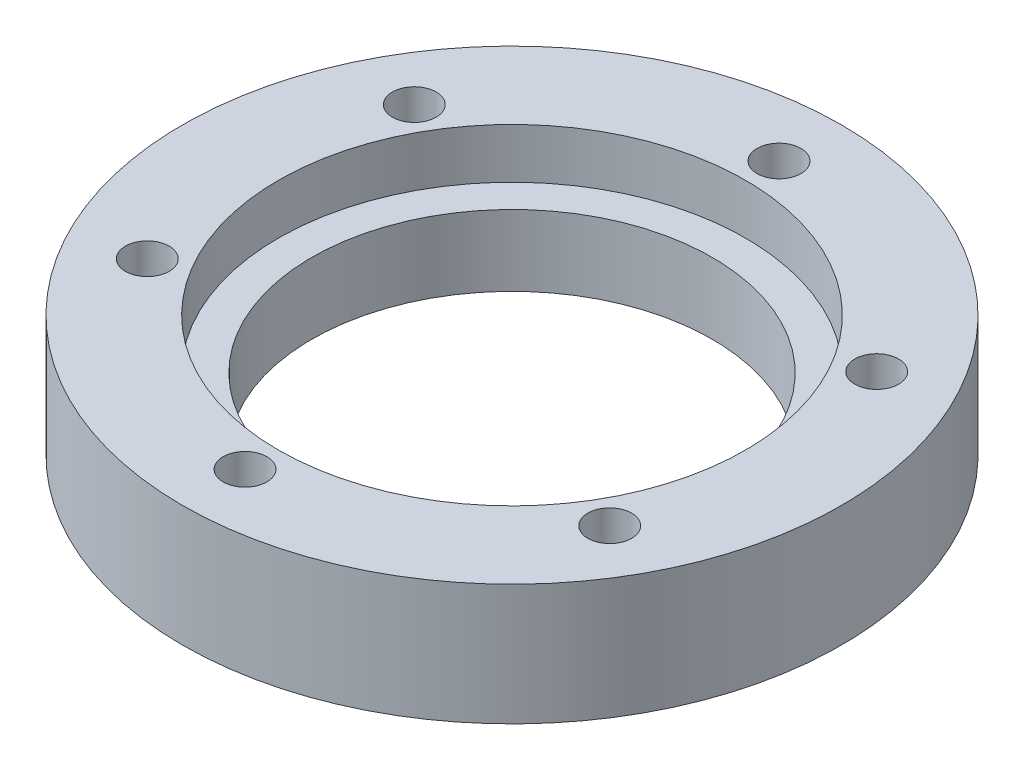
ISO-10303-21;
HEADER;
FILE_DESCRIPTION(('STEP AP214'),'2;1');
FILE_NAME('part.step','',(''),(''),'','','');
FILE_SCHEMA(('AUTOMOTIVE_DESIGN { 1 0 10303 214 1 1 1 1 }'));
ENDSEC;
DATA;
#1=APPLICATION_CONTEXT('core data for automotive mechanical design processes');
#2=APPLICATION_PROTOCOL_DEFINITION('international standard','automotive_design',2000,#1);
#3=PRODUCT_CONTEXT('',#1,'mechanical');
#4=PRODUCT('Part','Part','',(#3));
#5=PRODUCT_RELATED_PRODUCT_CATEGORY('part','',(#4));
#6=PRODUCT_DEFINITION_FORMATION('','',#4);
#7=PRODUCT_DEFINITION_CONTEXT('part definition',#1,'design');
#8=PRODUCT_DEFINITION('design','',#6,#7);
#9=PRODUCT_DEFINITION_SHAPE('','',#8);
#10=(LENGTH_UNIT() NAMED_UNIT(*) SI_UNIT(.MILLI.,.METRE.));
#11=(NAMED_UNIT(*) PLANE_ANGLE_UNIT() SI_UNIT($,.RADIAN.));
#12=(NAMED_UNIT(*) SI_UNIT($,.STERADIAN.) SOLID_ANGLE_UNIT());
#13=UNCERTAINTY_MEASURE_WITH_UNIT(LENGTH_MEASURE(1.E-05),#10,'distance_accuracy_value','');
#14=(GEOMETRIC_REPRESENTATION_CONTEXT(3) GLOBAL_UNCERTAINTY_ASSIGNED_CONTEXT((#13)) GLOBAL_UNIT_ASSIGNED_CONTEXT((#10,
#11,#12)) REPRESENTATION_CONTEXT('',''));
#15=CARTESIAN_POINT('',(0.,0.,0.));
#16=DIRECTION('',(0.,0.,1.));
#17=DIRECTION('',(1.,0.,0.));
#18=AXIS2_PLACEMENT_3D('',#15,#16,#17);
#19=CARTESIAN_POINT('',(0.,29.,0.));
#20=DIRECTION('',(0.,-1.,0.));
#21=DIRECTION('',(0.,0.,-1.));
#22=AXIS2_PLACEMENT_3D('',#19,#20,#21);
#23=CYLINDRICAL_SURFACE('',#22,79.);
#24=CARTESIAN_POINT('',(0.,29.,0.));
#25=DIRECTION('',(0.,1.,0.));
#26=DIRECTION('',(0.,0.,1.));
#27=AXIS2_PLACEMENT_3D('',#24,#25,#26);
#28=CIRCLE('',#27,79.);
#29=CARTESIAN_POINT('',(0.,29.,79.));
#30=VERTEX_POINT('',#29);
#31=EDGE_CURVE('E12',#30,#30,#28,.T.);
#32=ORIENTED_EDGE('',*,*,#31,.F.);
#33=EDGE_LOOP('',(#32));
#34=FACE_BOUND('',#33,.T.);
#35=CARTESIAN_POINT('',(0.,0.,0.));
#36=DIRECTION('',(0.,1.,0.));
#37=DIRECTION('',(0.,0.,1.));
#38=AXIS2_PLACEMENT_3D('',#35,#36,#37);
#39=CIRCLE('',#38,79.);
#40=CARTESIAN_POINT('',(0.,0.,79.));
#41=VERTEX_POINT('',#40);
#42=EDGE_CURVE('E52',#41,#41,#39,.T.);
#43=ORIENTED_EDGE('',*,*,#42,.T.);
#44=EDGE_LOOP('',(#43));
#45=FACE_BOUND('',#44,.T.);
#46=ADVANCED_FACE('F49',(#34,#45),#23,.T.);
#47=CARTESIAN_POINT('',(0.,29.,0.));
#48=DIRECTION('',(0.,1.,0.));
#49=DIRECTION('',(0.,0.,1.));
#50=AXIS2_PLACEMENT_3D('',#47,#48,#49);
#51=PLANE('',#50);
#52=CARTESIAN_POINT('',(7.42461647718073E-13,29.,64.));
#53=DIRECTION('',(0.,1.,0.));
#54=DIRECTION('',(0.,0.,1.));
#55=AXIS2_PLACEMENT_3D('',#52,#53,#54);
#56=CIRCLE('',#55,5.25);
#57=CARTESIAN_POINT('',(7.42461647718073E-13,29.,69.25));
#58=VERTEX_POINT('',#57);
#59=EDGE_CURVE('E105',#58,#58,#56,.T.);
#60=ORIENTED_EDGE('',*,*,#59,.F.);
#61=EDGE_LOOP('',(#60));
#62=FACE_BOUND('',#61,.T.);
#63=CARTESIAN_POINT('',(-55.4256258422038,29.,32.0000000000005));
#64=DIRECTION('',(0.,1.,0.));
#65=DIRECTION('',(0.,0.,1.));
#66=AXIS2_PLACEMENT_3D('',#63,#64,#65);
#67=CIRCLE('',#66,5.25);
#68=CARTESIAN_POINT('',(-55.4256258422038,29.,37.2500000000005));
#69=VERTEX_POINT('',#68);
#70=EDGE_CURVE('E99',#69,#69,#67,.T.);
#71=ORIENTED_EDGE('',*,*,#70,.F.);
#72=EDGE_LOOP('',(#71));
#73=FACE_BOUND('',#72,.T.);
#74=CARTESIAN_POINT('',(-55.4256258422041,29.,-32.));
#75=DIRECTION('',(0.,1.,0.));
#76=DIRECTION('',(0.,0.,1.));
#77=AXIS2_PLACEMENT_3D('',#74,#75,#76);
#78=CIRCLE('',#77,5.25);
#79=CARTESIAN_POINT('',(-55.4256258422041,29.,-26.75));
#80=VERTEX_POINT('',#79);
#81=EDGE_CURVE('E93',#80,#80,#78,.T.);
#82=ORIENTED_EDGE('',*,*,#81,.F.);
#83=EDGE_LOOP('',(#82));
#84=FACE_BOUND('',#83,.T.);
#85=CARTESIAN_POINT('',(-2.94902990916057E-13,29.,-64.));
#86=DIRECTION('',(0.,1.,0.));
#87=DIRECTION('',(0.,0.,1.));
#88=AXIS2_PLACEMENT_3D('',#85,#86,#87);
#89=CIRCLE('',#88,5.25);
#90=CARTESIAN_POINT('',(-2.94902990916057E-13,29.,-58.75));
#91=VERTEX_POINT('',#90);
#92=EDGE_CURVE('E87',#91,#91,#89,.T.);
#93=ORIENTED_EDGE('',*,*,#92,.F.);
#94=EDGE_LOOP('',(#93));
#95=FACE_BOUND('',#94,.T.);
#96=CARTESIAN_POINT('',(55.425625842204,29.,-32.0000000000001));
#97=DIRECTION('',(0.,1.,0.));
#98=DIRECTION('',(0.,0.,1.));
#99=AXIS2_PLACEMENT_3D('',#96,#97,#98);
#100=CIRCLE('',#99,5.25);
#101=CARTESIAN_POINT('',(55.425625842204,29.,-26.7500000000001));
#102=VERTEX_POINT('',#101);
#103=EDGE_CURVE('E81',#102,#102,#100,.T.);
#104=ORIENTED_EDGE('',*,*,#103,.F.);
#105=EDGE_LOOP('',(#104));
#106=FACE_BOUND('',#105,.T.);
#107=CARTESIAN_POINT('',(55.4256258422041,29.,32.));
#108=DIRECTION('',(0.,1.,0.));
#109=DIRECTION('',(0.,0.,1.));
#110=AXIS2_PLACEMENT_3D('',#107,#108,#109);
#111=CIRCLE('',#110,5.25);
#112=CARTESIAN_POINT('',(55.4256258422041,29.,37.25));
#113=VERTEX_POINT('',#112);
#114=EDGE_CURVE('E75',#113,#113,#111,.T.);
#115=ORIENTED_EDGE('',*,*,#114,.F.);
#116=EDGE_LOOP('',(#115));
#117=FACE_BOUND('',#116,.T.);
#118=CARTESIAN_POINT('',(0.,29.,0.));
#119=DIRECTION('',(0.,1.,0.));
#120=DIRECTION('',(0.,0.,1.));
#121=AXIS2_PLACEMENT_3D('',#118,#119,#120);
#122=CIRCLE('',#121,56.);
#123=CARTESIAN_POINT('',(0.,29.,56.));
#124=VERTEX_POINT('',#123);
#125=EDGE_CURVE('E69',#124,#124,#122,.T.);
#126=ORIENTED_EDGE('',*,*,#125,.F.);
#127=EDGE_LOOP('',(#126));
#128=FACE_BOUND('',#127,.T.);
#129=ORIENTED_EDGE('',*,*,#31,.T.);
#130=EDGE_LOOP('',(#129));
#131=FACE_BOUND('',#130,.T.);
#132=ADVANCED_FACE('F111',(#62,#73,#84,#95,#106,#117,#128,#131),#51,.T.);
#133=CARTESIAN_POINT('',(0.,0.,0.));
#134=DIRECTION('',(0.,1.,0.));
#135=DIRECTION('',(0.,0.,1.));
#136=AXIS2_PLACEMENT_3D('',#133,#134,#135);
#137=PLANE('',#136);
#138=CARTESIAN_POINT('',(7.42461647718073E-13,0.,64.));
#139=DIRECTION('',(0.,1.,0.));
#140=DIRECTION('',(0.,0.,1.));
#141=AXIS2_PLACEMENT_3D('',#138,#139,#140);
#142=CIRCLE('',#141,5.25);
#143=CARTESIAN_POINT('',(7.42461647718073E-13,0.,69.25));
#144=VERTEX_POINT('',#143);
#145=EDGE_CURVE('E102',#144,#144,#142,.T.);
#146=ORIENTED_EDGE('',*,*,#145,.T.);
#147=EDGE_LOOP('',(#146));
#148=FACE_BOUND('',#147,.T.);
#149=CARTESIAN_POINT('',(-55.4256258422038,0.,32.0000000000005));
#150=DIRECTION('',(0.,1.,0.));
#151=DIRECTION('',(0.,0.,1.));
#152=AXIS2_PLACEMENT_3D('',#149,#150,#151);
#153=CIRCLE('',#152,5.25);
#154=CARTESIAN_POINT('',(-55.4256258422038,0.,37.2500000000005));
#155=VERTEX_POINT('',#154);
#156=EDGE_CURVE('E96',#155,#155,#153,.T.);
#157=ORIENTED_EDGE('',*,*,#156,.T.);
#158=EDGE_LOOP('',(#157));
#159=FACE_BOUND('',#158,.T.);
#160=CARTESIAN_POINT('',(-55.4256258422041,0.,-32.));
#161=DIRECTION('',(0.,1.,0.));
#162=DIRECTION('',(0.,0.,1.));
#163=AXIS2_PLACEMENT_3D('',#160,#161,#162);
#164=CIRCLE('',#163,5.25);
#165=CARTESIAN_POINT('',(-55.4256258422041,0.,-26.75));
#166=VERTEX_POINT('',#165);
#167=EDGE_CURVE('E90',#166,#166,#164,.T.);
#168=ORIENTED_EDGE('',*,*,#167,.T.);
#169=EDGE_LOOP('',(#168));
#170=FACE_BOUND('',#169,.T.);
#171=CARTESIAN_POINT('',(-2.94902990916057E-13,0.,-64.));
#172=DIRECTION('',(0.,1.,0.));
#173=DIRECTION('',(0.,0.,1.));
#174=AXIS2_PLACEMENT_3D('',#171,#172,#173);
#175=CIRCLE('',#174,5.25);
#176=CARTESIAN_POINT('',(-2.94902990916057E-13,0.,-58.75));
#177=VERTEX_POINT('',#176);
#178=EDGE_CURVE('E84',#177,#177,#175,.T.);
#179=ORIENTED_EDGE('',*,*,#178,.T.);
#180=EDGE_LOOP('',(#179));
#181=FACE_BOUND('',#180,.T.);
#182=CARTESIAN_POINT('',(55.425625842204,0.,-32.0000000000001));
#183=DIRECTION('',(0.,1.,0.));
#184=DIRECTION('',(0.,0.,1.));
#185=AXIS2_PLACEMENT_3D('',#182,#183,#184);
#186=CIRCLE('',#185,5.25);
#187=CARTESIAN_POINT('',(55.425625842204,0.,-26.7500000000001));
#188=VERTEX_POINT('',#187);
#189=EDGE_CURVE('E78',#188,#188,#186,.T.);
#190=ORIENTED_EDGE('',*,*,#189,.T.);
#191=EDGE_LOOP('',(#190));
#192=FACE_BOUND('',#191,.T.);
#193=CARTESIAN_POINT('',(55.4256258422041,0.,32.));
#194=DIRECTION('',(0.,1.,0.));
#195=DIRECTION('',(0.,0.,1.));
#196=AXIS2_PLACEMENT_3D('',#193,#194,#195);
#197=CIRCLE('',#196,5.25);
#198=CARTESIAN_POINT('',(55.4256258422041,0.,37.25));
#199=VERTEX_POINT('',#198);
#200=EDGE_CURVE('E72',#199,#199,#197,.T.);
#201=ORIENTED_EDGE('',*,*,#200,.T.);
#202=EDGE_LOOP('',(#201));
#203=FACE_BOUND('',#202,.T.);
#204=CARTESIAN_POINT('',(0.,0.,0.));
#205=DIRECTION('',(0.,1.,0.));
#206=DIRECTION('',(0.,0.,1.));
#207=AXIS2_PLACEMENT_3D('',#204,#205,#206);
#208=CIRCLE('',#207,48.);
#209=CARTESIAN_POINT('',(0.,0.,48.));
#210=VERTEX_POINT('',#209);
#211=EDGE_CURVE('E59',#210,#210,#208,.T.);
#212=ORIENTED_EDGE('',*,*,#211,.T.);
#213=EDGE_LOOP('',(#212));
#214=FACE_BOUND('',#213,.T.);
#215=ORIENTED_EDGE('',*,*,#42,.F.);
#216=EDGE_LOOP('',(#215));
#217=FACE_BOUND('',#216,.T.);
#218=ADVANCED_FACE('F114',(#148,#159,#170,#181,#192,#203,#214,#217),#137,.F.);
#219=CARTESIAN_POINT('',(0.,29.,0.));
#220=DIRECTION('',(0.,1.,0.));
#221=DIRECTION('',(0.,0.,1.));
#222=AXIS2_PLACEMENT_3D('',#219,#220,#221);
#223=CYLINDRICAL_SURFACE('',#222,48.);
#224=ORIENTED_EDGE('',*,*,#211,.F.);
#225=EDGE_LOOP('',(#224));
#226=FACE_BOUND('',#225,.T.);
#227=CARTESIAN_POINT('',(0.,17.,0.));
#228=DIRECTION('',(0.,1.,0.));
#229=DIRECTION('',(0.,0.,1.));
#230=AXIS2_PLACEMENT_3D('',#227,#228,#229);
#231=CIRCLE('',#230,48.);
#232=CARTESIAN_POINT('',(0.,17.,48.));
#233=VERTEX_POINT('',#232);
#234=EDGE_CURVE('E63',#233,#233,#231,.T.);
#235=ORIENTED_EDGE('',*,*,#234,.T.);
#236=EDGE_LOOP('',(#235));
#237=FACE_BOUND('',#236,.T.);
#238=ADVANCED_FACE('F141',(#226,#237),#223,.F.);
#239=CARTESIAN_POINT('',(48.,17.,0.));
#240=DIRECTION('',(0.,-1.,0.));
#241=DIRECTION('',(0.,0.,-1.));
#242=AXIS2_PLACEMENT_3D('',#239,#240,#241);
#243=PLANE('',#242);
#244=ORIENTED_EDGE('',*,*,#234,.F.);
#245=EDGE_LOOP('',(#244));
#246=FACE_BOUND('',#245,.T.);
#247=CARTESIAN_POINT('',(0.,17.,0.));
#248=DIRECTION('',(0.,1.,0.));
#249=DIRECTION('',(0.,0.,1.));
#250=AXIS2_PLACEMENT_3D('',#247,#248,#249);
#251=CIRCLE('',#250,56.);
#252=CARTESIAN_POINT('',(0.,17.,56.));
#253=VERTEX_POINT('',#252);
#254=EDGE_CURVE('E66',#253,#253,#251,.T.);
#255=ORIENTED_EDGE('',*,*,#254,.T.);
#256=EDGE_LOOP('',(#255));
#257=FACE_BOUND('',#256,.T.);
#258=ADVANCED_FACE('F131',(#246,#257),#243,.F.);
#259=CARTESIAN_POINT('',(0.,29.,0.));
#260=DIRECTION('',(0.,1.,0.));
#261=DIRECTION('',(0.,0.,1.));
#262=AXIS2_PLACEMENT_3D('',#259,#260,#261);
#263=CYLINDRICAL_SURFACE('',#262,56.);
#264=ORIENTED_EDGE('',*,*,#254,.F.);
#265=EDGE_LOOP('',(#264));
#266=FACE_BOUND('',#265,.T.);
#267=ORIENTED_EDGE('',*,*,#125,.T.);
#268=EDGE_LOOP('',(#267));
#269=FACE_BOUND('',#268,.T.);
#270=ADVANCED_FACE('F128',(#266,#269),#263,.F.);
#271=CARTESIAN_POINT('',(55.4256258422041,29.,32.));
#272=DIRECTION('',(0.,1.,0.));
#273=DIRECTION('',(0.,0.,1.));
#274=AXIS2_PLACEMENT_3D('',#271,#272,#273);
#275=CYLINDRICAL_SURFACE('',#274,5.25);
#276=ORIENTED_EDGE('',*,*,#200,.F.);
#277=EDGE_LOOP('',(#276));
#278=FACE_BOUND('',#277,.T.);
#279=ORIENTED_EDGE('',*,*,#114,.T.);
#280=EDGE_LOOP('',(#279));
#281=FACE_BOUND('',#280,.T.);
#282=ADVANCED_FACE('F130',(#278,#281),#275,.F.);
#283=CARTESIAN_POINT('',(55.425625842204,29.,-32.0000000000001));
#284=DIRECTION('',(0.,1.,0.));
#285=DIRECTION('',(0.,0.,1.));
#286=AXIS2_PLACEMENT_3D('',#283,#284,#285);
#287=CYLINDRICAL_SURFACE('',#286,5.25);
#288=ORIENTED_EDGE('',*,*,#189,.F.);
#289=EDGE_LOOP('',(#288));
#290=FACE_BOUND('',#289,.T.);
#291=ORIENTED_EDGE('',*,*,#103,.T.);
#292=EDGE_LOOP('',(#291));
#293=FACE_BOUND('',#292,.T.);
#294=ADVANCED_FACE('F138',(#290,#293),#287,.F.);
#295=CARTESIAN_POINT('',(-2.94902990916057E-13,29.,-64.));
#296=DIRECTION('',(0.,1.,0.));
#297=DIRECTION('',(0.,0.,1.));
#298=AXIS2_PLACEMENT_3D('',#295,#296,#297);
#299=CYLINDRICAL_SURFACE('',#298,5.25);
#300=ORIENTED_EDGE('',*,*,#178,.F.);
#301=EDGE_LOOP('',(#300));
#302=FACE_BOUND('',#301,.T.);
#303=ORIENTED_EDGE('',*,*,#92,.T.);
#304=EDGE_LOOP('',(#303));
#305=FACE_BOUND('',#304,.T.);
#306=ADVANCED_FACE('F179',(#302,#305),#299,.F.);
#307=CARTESIAN_POINT('',(-55.4256258422041,29.,-32.));
#308=DIRECTION('',(0.,1.,0.));
#309=DIRECTION('',(0.,0.,1.));
#310=AXIS2_PLACEMENT_3D('',#307,#308,#309);
#311=CYLINDRICAL_SURFACE('',#310,5.25);
#312=ORIENTED_EDGE('',*,*,#167,.F.);
#313=EDGE_LOOP('',(#312));
#314=FACE_BOUND('',#313,.T.);
#315=ORIENTED_EDGE('',*,*,#81,.T.);
#316=EDGE_LOOP('',(#315));
#317=FACE_BOUND('',#316,.T.);
#318=ADVANCED_FACE('F184',(#314,#317),#311,.F.);
#319=CARTESIAN_POINT('',(-55.4256258422038,29.,32.0000000000005));
#320=DIRECTION('',(0.,1.,0.));
#321=DIRECTION('',(0.,0.,1.));
#322=AXIS2_PLACEMENT_3D('',#319,#320,#321);
#323=CYLINDRICAL_SURFACE('',#322,5.25);
#324=ORIENTED_EDGE('',*,*,#156,.F.);
#325=EDGE_LOOP('',(#324));
#326=FACE_BOUND('',#325,.T.);
#327=ORIENTED_EDGE('',*,*,#70,.T.);
#328=EDGE_LOOP('',(#327));
#329=FACE_BOUND('',#328,.T.);
#330=ADVANCED_FACE('F190',(#326,#329),#323,.F.);
#331=CARTESIAN_POINT('',(7.42461647718073E-13,29.,64.));
#332=DIRECTION('',(0.,1.,0.));
#333=DIRECTION('',(0.,0.,1.));
#334=AXIS2_PLACEMENT_3D('',#331,#332,#333);
#335=CYLINDRICAL_SURFACE('',#334,5.25);
#336=ORIENTED_EDGE('',*,*,#145,.F.);
#337=EDGE_LOOP('',(#336));
#338=FACE_BOUND('',#337,.T.);
#339=ORIENTED_EDGE('',*,*,#59,.T.);
#340=EDGE_LOOP('',(#339));
#341=FACE_BOUND('',#340,.T.);
#342=ADVANCED_FACE('F109',(#338,#341),#335,.F.);
#343=CLOSED_SHELL('',(#46,#132,#218,#238,#258,#270,#282,#294,#306,#318,#330,#342));
#344=MANIFOLD_SOLID_BREP('B2',#343);
#345=ADVANCED_BREP_SHAPE_REPRESENTATION('',(#18,#344),#14);
#346=SHAPE_DEFINITION_REPRESENTATION(#9,#345);
ENDSEC;
END-ISO-10303-21;
